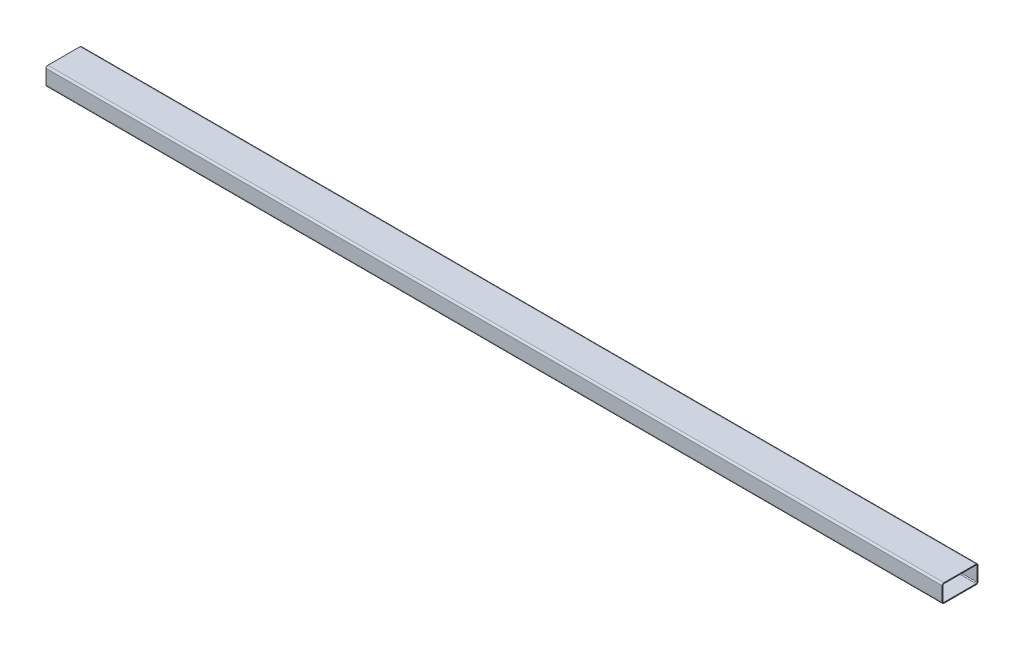
ISO-10303-21;
HEADER;
FILE_DESCRIPTION(('STEP AP214'),'2;1');
FILE_NAME('part.step','',(''),(''),'','','');
FILE_SCHEMA(('AUTOMOTIVE_DESIGN { 1 0 10303 214 1 1 1 1 }'));
ENDSEC;
DATA;
#1=APPLICATION_CONTEXT('core data for automotive mechanical design processes');
#2=APPLICATION_PROTOCOL_DEFINITION('international standard','automotive_design',2000,#1);
#3=PRODUCT_CONTEXT('',#1,'mechanical');
#4=PRODUCT('Part','Part','',(#3));
#5=PRODUCT_RELATED_PRODUCT_CATEGORY('part','',(#4));
#6=PRODUCT_DEFINITION_FORMATION('','',#4);
#7=PRODUCT_DEFINITION_CONTEXT('part definition',#1,'design');
#8=PRODUCT_DEFINITION('design','',#6,#7);
#9=PRODUCT_DEFINITION_SHAPE('','',#8);
#10=(LENGTH_UNIT() NAMED_UNIT(*) SI_UNIT(.MILLI.,.METRE.));
#11=(NAMED_UNIT(*) PLANE_ANGLE_UNIT() SI_UNIT($,.RADIAN.));
#12=(NAMED_UNIT(*) SI_UNIT($,.STERADIAN.) SOLID_ANGLE_UNIT());
#13=UNCERTAINTY_MEASURE_WITH_UNIT(LENGTH_MEASURE(1.E-05),#10,'distance_accuracy_value','');
#14=(GEOMETRIC_REPRESENTATION_CONTEXT(3) GLOBAL_UNCERTAINTY_ASSIGNED_CONTEXT((#13)) GLOBAL_UNIT_ASSIGNED_CONTEXT((#10,
#11,#12)) REPRESENTATION_CONTEXT('',''));
#15=CARTESIAN_POINT('',(0.,0.,0.));
#16=DIRECTION('',(0.,0.,1.));
#17=DIRECTION('',(1.,0.,0.));
#18=AXIS2_PLACEMENT_3D('',#15,#16,#17);
#19=CARTESIAN_POINT('',(1000.,16.,-36.));
#20=DIRECTION('',(-1.,0.,0.));
#21=DIRECTION('',(0.,0.,1.));
#22=AXIS2_PLACEMENT_3D('',#19,#20,#21);
#23=CYLINDRICAL_SURFACE('',#22,4.);
#24=CARTESIAN_POINT('',(-1000.,16.,-36.));
#25=DIRECTION('',(1.,0.,0.));
#26=DIRECTION('',(0.,0.,-1.));
#27=AXIS2_PLACEMENT_3D('',#24,#25,#26);
#28=CIRCLE('',#27,4.);
#29=CARTESIAN_POINT('',(-1000.,16.,-40.));
#30=VERTEX_POINT('',#29);
#31=CARTESIAN_POINT('',(-1000.,20.,-36.));
#32=VERTEX_POINT('',#31);
#33=EDGE_CURVE('E236',#30,#32,#28,.T.);
#34=ORIENTED_EDGE('',*,*,#33,.T.);
#35=DIRECTION('',(-1.,0.,0.));
#36=VECTOR('',#35,1.);
#37=CARTESIAN_POINT('',(1000.,20.,-36.));
#38=LINE('',#37,#36);
#39=CARTESIAN_POINT('',(1000.,20.,-36.));
#40=VERTEX_POINT('',#39);
#41=EDGE_CURVE('E12',#40,#32,#38,.T.);
#42=ORIENTED_EDGE('',*,*,#41,.F.);
#43=CARTESIAN_POINT('',(1000.,16.,-36.));
#44=DIRECTION('',(1.,0.,0.));
#45=DIRECTION('',(0.,0.,-1.));
#46=AXIS2_PLACEMENT_3D('',#43,#44,#45);
#47=CIRCLE('',#46,4.);
#48=CARTESIAN_POINT('',(1000.,16.,-40.));
#49=VERTEX_POINT('',#48);
#50=EDGE_CURVE('E314',#49,#40,#47,.T.);
#51=ORIENTED_EDGE('',*,*,#50,.F.);
#52=DIRECTION('',(-1.,0.,0.));
#53=VECTOR('',#52,1.);
#54=CARTESIAN_POINT('',(1000.,16.,-40.));
#55=LINE('',#54,#53);
#56=EDGE_CURVE('E251',#49,#30,#55,.T.);
#57=ORIENTED_EDGE('',*,*,#56,.T.);
#58=EDGE_LOOP('',(#34,#42,#51,#57));
#59=FACE_BOUND('',#58,.T.);
#60=ADVANCED_FACE('F64',(#59),#23,.T.);
#61=CARTESIAN_POINT('',(1000.,20.,-36.));
#62=DIRECTION('',(0.,-1.,0.));
#63=DIRECTION('',(0.,0.,-1.));
#64=AXIS2_PLACEMENT_3D('',#61,#62,#63);
#65=PLANE('',#64);
#66=DIRECTION('',(0.,0.,1.));
#67=VECTOR('',#66,1.);
#68=CARTESIAN_POINT('',(-1000.,20.,-36.));
#69=LINE('',#68,#67);
#70=CARTESIAN_POINT('',(-1000.,20.,36.));
#71=VERTEX_POINT('',#70);
#72=EDGE_CURVE('E239',#32,#71,#69,.T.);
#73=ORIENTED_EDGE('',*,*,#72,.T.);
#74=DIRECTION('',(-1.,0.,0.));
#75=VECTOR('',#74,1.);
#76=CARTESIAN_POINT('',(1000.,20.,36.));
#77=LINE('',#76,#75);
#78=CARTESIAN_POINT('',(1000.,20.,36.));
#79=VERTEX_POINT('',#78);
#80=EDGE_CURVE('E74',#79,#71,#77,.T.);
#81=ORIENTED_EDGE('',*,*,#80,.F.);
#82=DIRECTION('',(0.,0.,1.));
#83=VECTOR('',#82,1.);
#84=CARTESIAN_POINT('',(1000.,20.,-36.));
#85=LINE('',#84,#83);
#86=EDGE_CURVE('E316',#40,#79,#85,.T.);
#87=ORIENTED_EDGE('',*,*,#86,.F.);
#88=ORIENTED_EDGE('',*,*,#41,.T.);
#89=EDGE_LOOP('',(#73,#81,#87,#88));
#90=FACE_BOUND('',#89,.T.);
#91=ADVANCED_FACE('F351',(#90),#65,.F.);
#92=CARTESIAN_POINT('',(1000.,16.,36.));
#93=DIRECTION('',(-1.,0.,0.));
#94=DIRECTION('',(0.,0.,1.));
#95=AXIS2_PLACEMENT_3D('',#92,#93,#94);
#96=CYLINDRICAL_SURFACE('',#95,4.00000000000001);
#97=CARTESIAN_POINT('',(-1000.,16.,36.));
#98=DIRECTION('',(1.,0.,0.));
#99=DIRECTION('',(0.,0.,-1.));
#100=AXIS2_PLACEMENT_3D('',#97,#98,#99);
#101=CIRCLE('',#100,4.00000000000001);
#102=CARTESIAN_POINT('',(-1000.,16.,40.));
#103=VERTEX_POINT('',#102);
#104=EDGE_CURVE('E241',#71,#103,#101,.T.);
#105=ORIENTED_EDGE('',*,*,#104,.T.);
#106=DIRECTION('',(-1.,0.,0.));
#107=VECTOR('',#106,1.);
#108=CARTESIAN_POINT('',(1000.,16.,40.));
#109=LINE('',#108,#107);
#110=CARTESIAN_POINT('',(1000.,16.,40.));
#111=VERTEX_POINT('',#110);
#112=EDGE_CURVE('E258',#111,#103,#109,.T.);
#113=ORIENTED_EDGE('',*,*,#112,.F.);
#114=CARTESIAN_POINT('',(1000.,16.,36.));
#115=DIRECTION('',(1.,0.,0.));
#116=DIRECTION('',(0.,0.,-1.));
#117=AXIS2_PLACEMENT_3D('',#114,#115,#116);
#118=CIRCLE('',#117,4.00000000000001);
#119=EDGE_CURVE('E318',#79,#111,#118,.T.);
#120=ORIENTED_EDGE('',*,*,#119,.F.);
#121=ORIENTED_EDGE('',*,*,#80,.T.);
#122=EDGE_LOOP('',(#105,#113,#120,#121));
#123=FACE_BOUND('',#122,.T.);
#124=ADVANCED_FACE('F356',(#123),#96,.T.);
#125=CARTESIAN_POINT('',(1000.,16.,40.));
#126=DIRECTION('',(0.,0.,-1.));
#127=DIRECTION('',(-1.,0.,0.));
#128=AXIS2_PLACEMENT_3D('',#125,#126,#127);
#129=PLANE('',#128);
#130=DIRECTION('',(0.,-1.,0.));
#131=VECTOR('',#130,1.);
#132=CARTESIAN_POINT('',(-1000.,16.,40.));
#133=LINE('',#132,#131);
#134=CARTESIAN_POINT('',(-1000.,-16.,40.));
#135=VERTEX_POINT('',#134);
#136=EDGE_CURVE('E243',#103,#135,#133,.T.);
#137=ORIENTED_EDGE('',*,*,#136,.T.);
#138=DIRECTION('',(-1.,0.,0.));
#139=VECTOR('',#138,1.);
#140=CARTESIAN_POINT('',(1000.,-16.,40.));
#141=LINE('',#140,#139);
#142=CARTESIAN_POINT('',(1000.,-16.,40.));
#143=VERTEX_POINT('',#142);
#144=EDGE_CURVE('E255',#143,#135,#141,.T.);
#145=ORIENTED_EDGE('',*,*,#144,.F.);
#146=DIRECTION('',(0.,-1.,0.));
#147=VECTOR('',#146,1.);
#148=CARTESIAN_POINT('',(1000.,16.,40.));
#149=LINE('',#148,#147);
#150=EDGE_CURVE('E320',#111,#143,#149,.T.);
#151=ORIENTED_EDGE('',*,*,#150,.F.);
#152=ORIENTED_EDGE('',*,*,#112,.T.);
#153=EDGE_LOOP('',(#137,#145,#151,#152));
#154=FACE_BOUND('',#153,.T.);
#155=ADVANCED_FACE('F326',(#154),#129,.F.);
#156=CARTESIAN_POINT('',(1000.,-16.,36.));
#157=DIRECTION('',(-1.,0.,0.));
#158=DIRECTION('',(0.,0.,1.));
#159=AXIS2_PLACEMENT_3D('',#156,#157,#158);
#160=CYLINDRICAL_SURFACE('',#159,4.00000000000001);
#161=CARTESIAN_POINT('',(-1000.,-16.,36.));
#162=DIRECTION('',(1.,0.,0.));
#163=DIRECTION('',(0.,0.,-1.));
#164=AXIS2_PLACEMENT_3D('',#161,#162,#163);
#165=CIRCLE('',#164,4.00000000000001);
#166=CARTESIAN_POINT('',(-1000.,-20.,36.));
#167=VERTEX_POINT('',#166);
#168=EDGE_CURVE('E245',#135,#167,#165,.T.);
#169=ORIENTED_EDGE('',*,*,#168,.T.);
#170=DIRECTION('',(-1.,0.,0.));
#171=VECTOR('',#170,1.);
#172=CARTESIAN_POINT('',(1000.,-20.,36.));
#173=LINE('',#172,#171);
#174=CARTESIAN_POINT('',(1000.,-20.,36.));
#175=VERTEX_POINT('',#174);
#176=EDGE_CURVE('E203',#175,#167,#173,.T.);
#177=ORIENTED_EDGE('',*,*,#176,.F.);
#178=CARTESIAN_POINT('',(1000.,-16.,36.));
#179=DIRECTION('',(1.,0.,0.));
#180=DIRECTION('',(0.,0.,-1.));
#181=AXIS2_PLACEMENT_3D('',#178,#179,#180);
#182=CIRCLE('',#181,4.00000000000001);
#183=EDGE_CURVE('E194',#143,#175,#182,.T.);
#184=ORIENTED_EDGE('',*,*,#183,.F.);
#185=ORIENTED_EDGE('',*,*,#144,.T.);
#186=EDGE_LOOP('',(#169,#177,#184,#185));
#187=FACE_BOUND('',#186,.T.);
#188=ADVANCED_FACE('F330',(#187),#160,.T.);
#189=CARTESIAN_POINT('',(1000.,-20.,-36.));
#190=DIRECTION('',(0.,1.,0.));
#191=DIRECTION('',(0.,0.,1.));
#192=AXIS2_PLACEMENT_3D('',#189,#190,#191);
#193=PLANE('',#192);
#194=DIRECTION('',(0.,0.,-1.));
#195=VECTOR('',#194,1.);
#196=CARTESIAN_POINT('',(-1000.,-20.,-36.));
#197=LINE('',#196,#195);
#198=CARTESIAN_POINT('',(-1000.,-20.,-36.));
#199=VERTEX_POINT('',#198);
#200=EDGE_CURVE('E202',#167,#199,#197,.T.);
#201=ORIENTED_EDGE('',*,*,#200,.T.);
#202=DIRECTION('',(-1.,0.,0.));
#203=VECTOR('',#202,1.);
#204=CARTESIAN_POINT('',(1000.,-20.,-36.));
#205=LINE('',#204,#203);
#206=CARTESIAN_POINT('',(1000.,-20.,-36.));
#207=VERTEX_POINT('',#206);
#208=EDGE_CURVE('E199',#207,#199,#205,.T.);
#209=ORIENTED_EDGE('',*,*,#208,.F.);
#210=DIRECTION('',(0.,0.,-1.));
#211=VECTOR('',#210,1.);
#212=CARTESIAN_POINT('',(1000.,-20.,-36.));
#213=LINE('',#212,#211);
#214=EDGE_CURVE('E188',#175,#207,#213,.T.);
#215=ORIENTED_EDGE('',*,*,#214,.F.);
#216=ORIENTED_EDGE('',*,*,#176,.T.);
#217=EDGE_LOOP('',(#201,#209,#215,#216));
#218=FACE_BOUND('',#217,.T.);
#219=ADVANCED_FACE('F200',(#218),#193,.F.);
#220=CARTESIAN_POINT('',(1000.,-16.,-36.));
#221=DIRECTION('',(-1.,0.,0.));
#222=DIRECTION('',(0.,0.,1.));
#223=AXIS2_PLACEMENT_3D('',#220,#221,#222);
#224=CYLINDRICAL_SURFACE('',#223,4.);
#225=CARTESIAN_POINT('',(-1000.,-16.,-36.));
#226=DIRECTION('',(1.,0.,0.));
#227=DIRECTION('',(0.,0.,1.));
#228=AXIS2_PLACEMENT_3D('',#225,#226,#227);
#229=CIRCLE('',#228,4.);
#230=CARTESIAN_POINT('',(-1000.,-16.,-40.));
#231=VERTEX_POINT('',#230);
#232=EDGE_CURVE('E136',#199,#231,#229,.T.);
#233=ORIENTED_EDGE('',*,*,#232,.T.);
#234=DIRECTION('',(-1.,0.,0.));
#235=VECTOR('',#234,1.);
#236=CARTESIAN_POINT('',(1000.,-16.,-40.));
#237=LINE('',#236,#235);
#238=CARTESIAN_POINT('',(1000.,-16.,-40.));
#239=VERTEX_POINT('',#238);
#240=EDGE_CURVE('E204',#239,#231,#237,.T.);
#241=ORIENTED_EDGE('',*,*,#240,.F.);
#242=CARTESIAN_POINT('',(1000.,-16.,-36.));
#243=DIRECTION('',(1.,0.,0.));
#244=DIRECTION('',(0.,0.,1.));
#245=AXIS2_PLACEMENT_3D('',#242,#243,#244);
#246=CIRCLE('',#245,4.);
#247=EDGE_CURVE('E192',#207,#239,#246,.T.);
#248=ORIENTED_EDGE('',*,*,#247,.F.);
#249=ORIENTED_EDGE('',*,*,#208,.T.);
#250=EDGE_LOOP('',(#233,#241,#248,#249));
#251=FACE_BOUND('',#250,.T.);
#252=ADVANCED_FACE('F206',(#251),#224,.T.);
#253=CARTESIAN_POINT('',(1000.,16.,36.));
#254=DIRECTION('',(-1.,0.,0.));
#255=DIRECTION('',(0.,0.,1.));
#256=AXIS2_PLACEMENT_3D('',#253,#254,#255);
#257=CYLINDRICAL_SURFACE('',#256,2.);
#258=CARTESIAN_POINT('',(-1000.,16.,36.));
#259=DIRECTION('',(1.,0.,0.));
#260=DIRECTION('',(0.,0.,-1.));
#261=AXIS2_PLACEMENT_3D('',#258,#259,#260);
#262=CIRCLE('',#261,2.);
#263=CARTESIAN_POINT('',(-1000.,18.,36.));
#264=VERTEX_POINT('',#263);
#265=CARTESIAN_POINT('',(-1000.,16.,38.));
#266=VERTEX_POINT('',#265);
#267=EDGE_CURVE('E212',#264,#266,#262,.T.);
#268=ORIENTED_EDGE('',*,*,#267,.F.);
#269=DIRECTION('',(-1.,0.,0.));
#270=VECTOR('',#269,1.);
#271=CARTESIAN_POINT('',(1000.,18.,36.));
#272=LINE('',#271,#270);
#273=CARTESIAN_POINT('',(1000.,18.,36.));
#274=VERTEX_POINT('',#273);
#275=EDGE_CURVE('E68',#274,#264,#272,.T.);
#276=ORIENTED_EDGE('',*,*,#275,.F.);
#277=CARTESIAN_POINT('',(1000.,16.,36.));
#278=DIRECTION('',(1.,0.,0.));
#279=DIRECTION('',(0.,0.,-1.));
#280=AXIS2_PLACEMENT_3D('',#277,#278,#279);
#281=CIRCLE('',#280,2.);
#282=CARTESIAN_POINT('',(1000.,16.,38.));
#283=VERTEX_POINT('',#282);
#284=EDGE_CURVE('E250',#274,#283,#281,.T.);
#285=ORIENTED_EDGE('',*,*,#284,.T.);
#286=DIRECTION('',(-1.,0.,0.));
#287=VECTOR('',#286,1.);
#288=CARTESIAN_POINT('',(1000.,16.,38.));
#289=LINE('',#288,#287);
#290=EDGE_CURVE('E208',#283,#266,#289,.T.);
#291=ORIENTED_EDGE('',*,*,#290,.T.);
#292=EDGE_LOOP('',(#268,#276,#285,#291));
#293=FACE_BOUND('',#292,.T.);
#294=ADVANCED_FACE('F66',(#293),#257,.F.);
#295=CARTESIAN_POINT('',(1000.,18.,-36.));
#296=DIRECTION('',(0.,-1.,0.));
#297=DIRECTION('',(0.,0.,-1.));
#298=AXIS2_PLACEMENT_3D('',#295,#296,#297);
#299=PLANE('',#298);
#300=DIRECTION('',(0.,0.,1.));
#301=VECTOR('',#300,1.);
#302=CARTESIAN_POINT('',(-1000.,18.,-36.));
#303=LINE('',#302,#301);
#304=CARTESIAN_POINT('',(-1000.,18.,-36.));
#305=VERTEX_POINT('',#304);
#306=EDGE_CURVE('E215',#305,#264,#303,.T.);
#307=ORIENTED_EDGE('',*,*,#306,.F.);
#308=DIRECTION('',(-1.,0.,0.));
#309=VECTOR('',#308,1.);
#310=CARTESIAN_POINT('',(1000.,18.,-36.));
#311=LINE('',#310,#309);
#312=CARTESIAN_POINT('',(1000.,18.,-36.));
#313=VERTEX_POINT('',#312);
#314=EDGE_CURVE('E273',#313,#305,#311,.T.);
#315=ORIENTED_EDGE('',*,*,#314,.F.);
#316=DIRECTION('',(0.,0.,1.));
#317=VECTOR('',#316,1.);
#318=CARTESIAN_POINT('',(1000.,18.,-36.));
#319=LINE('',#318,#317);
#320=EDGE_CURVE('E282',#313,#274,#319,.T.);
#321=ORIENTED_EDGE('',*,*,#320,.T.);
#322=ORIENTED_EDGE('',*,*,#275,.T.);
#323=EDGE_LOOP('',(#307,#315,#321,#322));
#324=FACE_BOUND('',#323,.T.);
#325=ADVANCED_FACE('F280',(#324),#299,.T.);
#326=CARTESIAN_POINT('',(1000.,16.,-36.));
#327=DIRECTION('',(-1.,0.,0.));
#328=DIRECTION('',(0.,0.,1.));
#329=AXIS2_PLACEMENT_3D('',#326,#327,#328);
#330=CYLINDRICAL_SURFACE('',#329,2.);
#331=CARTESIAN_POINT('',(-1000.,16.,-36.));
#332=DIRECTION('',(1.,0.,0.));
#333=DIRECTION('',(0.,0.,-1.));
#334=AXIS2_PLACEMENT_3D('',#331,#332,#333);
#335=CIRCLE('',#334,2.);
#336=CARTESIAN_POINT('',(-1000.,16.,-38.));
#337=VERTEX_POINT('',#336);
#338=EDGE_CURVE('E218',#337,#305,#335,.T.);
#339=ORIENTED_EDGE('',*,*,#338,.F.);
#340=DIRECTION('',(-1.,0.,0.));
#341=VECTOR('',#340,1.);
#342=CARTESIAN_POINT('',(1000.,16.,-38.));
#343=LINE('',#342,#341);
#344=CARTESIAN_POINT('',(1000.,16.,-38.));
#345=VERTEX_POINT('',#344);
#346=EDGE_CURVE('E272',#345,#337,#343,.T.);
#347=ORIENTED_EDGE('',*,*,#346,.F.);
#348=CARTESIAN_POINT('',(1000.,16.,-36.));
#349=DIRECTION('',(1.,0.,0.));
#350=DIRECTION('',(0.,0.,-1.));
#351=AXIS2_PLACEMENT_3D('',#348,#349,#350);
#352=CIRCLE('',#351,2.);
#353=EDGE_CURVE('E290',#345,#313,#352,.T.);
#354=ORIENTED_EDGE('',*,*,#353,.T.);
#355=ORIENTED_EDGE('',*,*,#314,.T.);
#356=EDGE_LOOP('',(#339,#347,#354,#355));
#357=FACE_BOUND('',#356,.T.);
#358=ADVANCED_FACE('F288',(#357),#330,.F.);
#359=CARTESIAN_POINT('',(1000.,16.,-38.));
#360=DIRECTION('',(0.,0.,1.));
#361=DIRECTION('',(1.,0.,0.));
#362=AXIS2_PLACEMENT_3D('',#359,#360,#361);
#363=PLANE('',#362);
#364=DIRECTION('',(0.,1.,0.));
#365=VECTOR('',#364,1.);
#366=CARTESIAN_POINT('',(-1000.,16.,-38.));
#367=LINE('',#366,#365);
#368=CARTESIAN_POINT('',(-1000.,-16.,-38.));
#369=VERTEX_POINT('',#368);
#370=EDGE_CURVE('E221',#369,#337,#367,.T.);
#371=ORIENTED_EDGE('',*,*,#370,.F.);
#372=DIRECTION('',(-1.,0.,0.));
#373=VECTOR('',#372,1.);
#374=CARTESIAN_POINT('',(1000.,-16.,-38.));
#375=LINE('',#374,#373);
#376=CARTESIAN_POINT('',(1000.,-16.,-38.));
#377=VERTEX_POINT('',#376);
#378=EDGE_CURVE('E270',#377,#369,#375,.T.);
#379=ORIENTED_EDGE('',*,*,#378,.F.);
#380=DIRECTION('',(0.,1.,0.));
#381=VECTOR('',#380,1.);
#382=CARTESIAN_POINT('',(1000.,16.,-38.));
#383=LINE('',#382,#381);
#384=EDGE_CURVE('E296',#377,#345,#383,.T.);
#385=ORIENTED_EDGE('',*,*,#384,.T.);
#386=ORIENTED_EDGE('',*,*,#346,.T.);
#387=EDGE_LOOP('',(#371,#379,#385,#386));
#388=FACE_BOUND('',#387,.T.);
#389=ADVANCED_FACE('F299',(#388),#363,.T.);
#390=CARTESIAN_POINT('',(1000.,-16.,-36.));
#391=DIRECTION('',(-1.,0.,0.));
#392=DIRECTION('',(0.,0.,1.));
#393=AXIS2_PLACEMENT_3D('',#390,#391,#392);
#394=CYLINDRICAL_SURFACE('',#393,2.);
#395=CARTESIAN_POINT('',(-1000.,-16.,-36.));
#396=DIRECTION('',(1.,0.,0.));
#397=DIRECTION('',(0.,0.,1.));
#398=AXIS2_PLACEMENT_3D('',#395,#396,#397);
#399=CIRCLE('',#398,2.);
#400=CARTESIAN_POINT('',(-1000.,-18.,-36.));
#401=VERTEX_POINT('',#400);
#402=EDGE_CURVE('E224',#401,#369,#399,.T.);
#403=ORIENTED_EDGE('',*,*,#402,.F.);
#404=DIRECTION('',(-1.,0.,0.));
#405=VECTOR('',#404,1.);
#406=CARTESIAN_POINT('',(1000.,-18.,-36.));
#407=LINE('',#406,#405);
#408=CARTESIAN_POINT('',(1000.,-18.,-36.));
#409=VERTEX_POINT('',#408);
#410=EDGE_CURVE('E268',#409,#401,#407,.T.);
#411=ORIENTED_EDGE('',*,*,#410,.F.);
#412=CARTESIAN_POINT('',(1000.,-16.,-36.));
#413=DIRECTION('',(1.,0.,0.));
#414=DIRECTION('',(0.,0.,1.));
#415=AXIS2_PLACEMENT_3D('',#412,#413,#414);
#416=CIRCLE('',#415,2.);
#417=EDGE_CURVE('E300',#409,#377,#416,.T.);
#418=ORIENTED_EDGE('',*,*,#417,.T.);
#419=ORIENTED_EDGE('',*,*,#378,.T.);
#420=EDGE_LOOP('',(#403,#411,#418,#419));
#421=FACE_BOUND('',#420,.T.);
#422=ADVANCED_FACE('F367',(#421),#394,.F.);
#423=CARTESIAN_POINT('',(1000.,-18.,-36.));
#424=DIRECTION('',(0.,1.,0.));
#425=DIRECTION('',(0.,0.,1.));
#426=AXIS2_PLACEMENT_3D('',#423,#424,#425);
#427=PLANE('',#426);
#428=DIRECTION('',(0.,0.,-1.));
#429=VECTOR('',#428,1.);
#430=CARTESIAN_POINT('',(-1000.,-18.,-36.));
#431=LINE('',#430,#429);
#432=CARTESIAN_POINT('',(-1000.,-18.,36.));
#433=VERTEX_POINT('',#432);
#434=EDGE_CURVE('E227',#433,#401,#431,.T.);
#435=ORIENTED_EDGE('',*,*,#434,.F.);
#436=DIRECTION('',(-1.,0.,0.));
#437=VECTOR('',#436,1.);
#438=CARTESIAN_POINT('',(1000.,-18.,36.));
#439=LINE('',#438,#437);
#440=CARTESIAN_POINT('',(1000.,-18.,36.));
#441=VERTEX_POINT('',#440);
#442=EDGE_CURVE('E266',#441,#433,#439,.T.);
#443=ORIENTED_EDGE('',*,*,#442,.F.);
#444=DIRECTION('',(0.,0.,-1.));
#445=VECTOR('',#444,1.);
#446=CARTESIAN_POINT('',(1000.,-18.,-36.));
#447=LINE('',#446,#445);
#448=EDGE_CURVE('E302',#441,#409,#447,.T.);
#449=ORIENTED_EDGE('',*,*,#448,.T.);
#450=ORIENTED_EDGE('',*,*,#410,.T.);
#451=EDGE_LOOP('',(#435,#443,#449,#450));
#452=FACE_BOUND('',#451,.T.);
#453=ADVANCED_FACE('F363',(#452),#427,.T.);
#454=CARTESIAN_POINT('',(1000.,-16.,36.));
#455=DIRECTION('',(-1.,0.,0.));
#456=DIRECTION('',(0.,0.,1.));
#457=AXIS2_PLACEMENT_3D('',#454,#455,#456);
#458=CYLINDRICAL_SURFACE('',#457,2.);
#459=CARTESIAN_POINT('',(-1000.,-16.,36.));
#460=DIRECTION('',(1.,0.,0.));
#461=DIRECTION('',(0.,0.,-1.));
#462=AXIS2_PLACEMENT_3D('',#459,#460,#461);
#463=CIRCLE('',#462,2.);
#464=CARTESIAN_POINT('',(-1000.,-16.,38.));
#465=VERTEX_POINT('',#464);
#466=EDGE_CURVE('E230',#465,#433,#463,.T.);
#467=ORIENTED_EDGE('',*,*,#466,.F.);
#468=DIRECTION('',(-1.,0.,0.));
#469=VECTOR('',#468,1.);
#470=CARTESIAN_POINT('',(1000.,-16.,38.));
#471=LINE('',#470,#469);
#472=CARTESIAN_POINT('',(1000.,-16.,38.));
#473=VERTEX_POINT('',#472);
#474=EDGE_CURVE('E264',#473,#465,#471,.T.);
#475=ORIENTED_EDGE('',*,*,#474,.F.);
#476=CARTESIAN_POINT('',(1000.,-16.,36.));
#477=DIRECTION('',(1.,0.,0.));
#478=DIRECTION('',(0.,0.,-1.));
#479=AXIS2_PLACEMENT_3D('',#476,#477,#478);
#480=CIRCLE('',#479,2.);
#481=EDGE_CURVE('E308',#473,#441,#480,.T.);
#482=ORIENTED_EDGE('',*,*,#481,.T.);
#483=ORIENTED_EDGE('',*,*,#442,.T.);
#484=EDGE_LOOP('',(#467,#475,#482,#483));
#485=FACE_BOUND('',#484,.T.);
#486=ADVANCED_FACE('F345',(#485),#458,.F.);
#487=CARTESIAN_POINT('',(1000.,16.,38.));
#488=DIRECTION('',(0.,0.,-1.));
#489=DIRECTION('',(-1.,0.,0.));
#490=AXIS2_PLACEMENT_3D('',#487,#488,#489);
#491=PLANE('',#490);
#492=DIRECTION('',(0.,-1.,0.));
#493=VECTOR('',#492,1.);
#494=CARTESIAN_POINT('',(-1000.,16.,38.));
#495=LINE('',#494,#493);
#496=EDGE_CURVE('E233',#266,#465,#495,.T.);
#497=ORIENTED_EDGE('',*,*,#496,.F.);
#498=ORIENTED_EDGE('',*,*,#290,.F.);
#499=DIRECTION('',(0.,-1.,0.));
#500=VECTOR('',#499,1.);
#501=CARTESIAN_POINT('',(1000.,16.,38.));
#502=LINE('',#501,#500);
#503=EDGE_CURVE('E311',#283,#473,#502,.T.);
#504=ORIENTED_EDGE('',*,*,#503,.T.);
#505=ORIENTED_EDGE('',*,*,#474,.T.);
#506=EDGE_LOOP('',(#497,#498,#504,#505));
#507=FACE_BOUND('',#506,.T.);
#508=ADVANCED_FACE('F338',(#507),#491,.T.);
#509=CARTESIAN_POINT('',(1000.,16.,-40.));
#510=DIRECTION('',(0.,0.,1.));
#511=DIRECTION('',(0.,-1.,0.));
#512=AXIS2_PLACEMENT_3D('',#509,#510,#511);
#513=PLANE('',#512);
#514=DIRECTION('',(0.,1.,0.));
#515=VECTOR('',#514,1.);
#516=CARTESIAN_POINT('',(-1000.,16.,-40.));
#517=LINE('',#516,#515);
#518=EDGE_CURVE('E142',#231,#30,#517,.T.);
#519=ORIENTED_EDGE('',*,*,#518,.T.);
#520=ORIENTED_EDGE('',*,*,#56,.F.);
#521=DIRECTION('',(0.,1.,0.));
#522=VECTOR('',#521,1.);
#523=CARTESIAN_POINT('',(1000.,16.,-40.));
#524=LINE('',#523,#522);
#525=EDGE_CURVE('E83',#239,#49,#524,.T.);
#526=ORIENTED_EDGE('',*,*,#525,.F.);
#527=ORIENTED_EDGE('',*,*,#240,.T.);
#528=EDGE_LOOP('',(#519,#520,#526,#527));
#529=FACE_BOUND('',#528,.T.);
#530=ADVANCED_FACE('F336',(#529),#513,.F.);
#531=CARTESIAN_POINT('',(1000.,16.,-36.));
#532=DIRECTION('',(1.,0.,0.));
#533=DIRECTION('',(0.,0.,-1.));
#534=AXIS2_PLACEMENT_3D('',#531,#532,#533);
#535=PLANE('',#534);
#536=ORIENTED_EDGE('',*,*,#284,.F.);
#537=ORIENTED_EDGE('',*,*,#320,.F.);
#538=ORIENTED_EDGE('',*,*,#353,.F.);
#539=ORIENTED_EDGE('',*,*,#384,.F.);
#540=ORIENTED_EDGE('',*,*,#417,.F.);
#541=ORIENTED_EDGE('',*,*,#448,.F.);
#542=ORIENTED_EDGE('',*,*,#481,.F.);
#543=ORIENTED_EDGE('',*,*,#503,.F.);
#544=EDGE_LOOP('',(#536,#537,#538,#539,#540,#541,#542,#543));
#545=FACE_BOUND('',#544,.T.);
#546=ORIENTED_EDGE('',*,*,#50,.T.);
#547=ORIENTED_EDGE('',*,*,#86,.T.);
#548=ORIENTED_EDGE('',*,*,#119,.T.);
#549=ORIENTED_EDGE('',*,*,#150,.T.);
#550=ORIENTED_EDGE('',*,*,#183,.T.);
#551=ORIENTED_EDGE('',*,*,#214,.T.);
#552=ORIENTED_EDGE('',*,*,#247,.T.);
#553=ORIENTED_EDGE('',*,*,#525,.T.);
#554=EDGE_LOOP('',(#546,#547,#548,#549,#550,#551,#552,#553));
#555=FACE_BOUND('',#554,.T.);
#556=ADVANCED_FACE('F190',(#545,#555),#535,.T.);
#557=CARTESIAN_POINT('',(-1000.,16.,-36.));
#558=DIRECTION('',(1.,0.,0.));
#559=DIRECTION('',(0.,0.,-1.));
#560=AXIS2_PLACEMENT_3D('',#557,#558,#559);
#561=PLANE('',#560);
#562=ORIENTED_EDGE('',*,*,#267,.T.);
#563=ORIENTED_EDGE('',*,*,#496,.T.);
#564=ORIENTED_EDGE('',*,*,#466,.T.);
#565=ORIENTED_EDGE('',*,*,#434,.T.);
#566=ORIENTED_EDGE('',*,*,#402,.T.);
#567=ORIENTED_EDGE('',*,*,#370,.T.);
#568=ORIENTED_EDGE('',*,*,#338,.T.);
#569=ORIENTED_EDGE('',*,*,#306,.T.);
#570=EDGE_LOOP('',(#562,#563,#564,#565,#566,#567,#568,#569));
#571=FACE_BOUND('',#570,.T.);
#572=ORIENTED_EDGE('',*,*,#33,.F.);
#573=ORIENTED_EDGE('',*,*,#518,.F.);
#574=ORIENTED_EDGE('',*,*,#232,.F.);
#575=ORIENTED_EDGE('',*,*,#200,.F.);
#576=ORIENTED_EDGE('',*,*,#168,.F.);
#577=ORIENTED_EDGE('',*,*,#136,.F.);
#578=ORIENTED_EDGE('',*,*,#104,.F.);
#579=ORIENTED_EDGE('',*,*,#72,.F.);
#580=EDGE_LOOP('',(#572,#573,#574,#575,#576,#577,#578,#579));
#581=FACE_BOUND('',#580,.T.);
#582=ADVANCED_FACE('F285',(#571,#581),#561,.F.);
#583=CLOSED_SHELL('',(#60,#91,#124,#155,#188,#219,#252,#294,#325,#358,#389,#422,#453,#486,#508,
#530,#556,#582));
#584=MANIFOLD_SOLID_BREP('B2',#583);
#585=ADVANCED_BREP_SHAPE_REPRESENTATION('',(#18,#584),#14);
#586=SHAPE_DEFINITION_REPRESENTATION(#9,#585);
ENDSEC;
END-ISO-10303-21;
